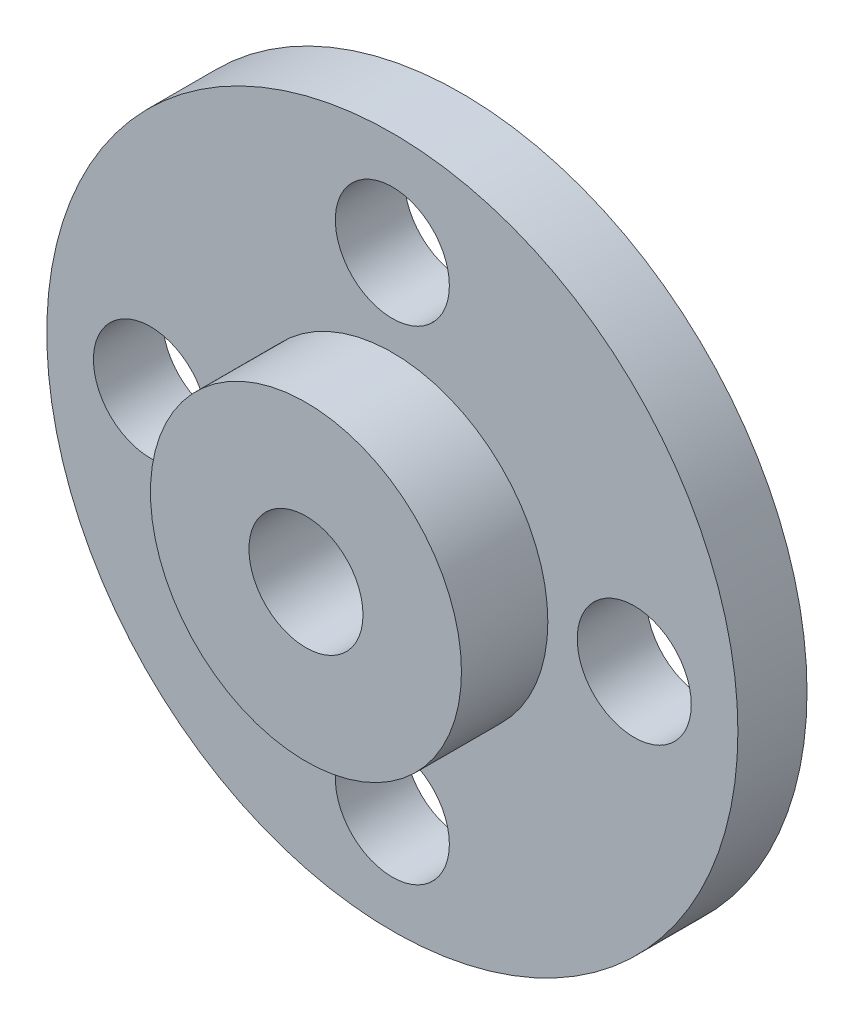
ISO-10303-21;
HEADER;
FILE_DESCRIPTION(('STEP AP214'),'2;1');
FILE_NAME('part.step','',(''),(''),'','','');
FILE_SCHEMA(('AUTOMOTIVE_DESIGN { 1 0 10303 214 1 1 1 1 }'));
ENDSEC;
DATA;
#1=APPLICATION_CONTEXT('core data for automotive mechanical design processes');
#2=APPLICATION_PROTOCOL_DEFINITION('international standard','automotive_design',2000,#1);
#3=PRODUCT_CONTEXT('',#1,'mechanical');
#4=PRODUCT('Part','Part','',(#3));
#5=PRODUCT_RELATED_PRODUCT_CATEGORY('part','',(#4));
#6=PRODUCT_DEFINITION_FORMATION('','',#4);
#7=PRODUCT_DEFINITION_CONTEXT('part definition',#1,'design');
#8=PRODUCT_DEFINITION('design','',#6,#7);
#9=PRODUCT_DEFINITION_SHAPE('','',#8);
#10=(LENGTH_UNIT() NAMED_UNIT(*) SI_UNIT(.MILLI.,.METRE.));
#11=(NAMED_UNIT(*) PLANE_ANGLE_UNIT() SI_UNIT($,.RADIAN.));
#12=(NAMED_UNIT(*) SI_UNIT($,.STERADIAN.) SOLID_ANGLE_UNIT());
#13=UNCERTAINTY_MEASURE_WITH_UNIT(LENGTH_MEASURE(1.E-05),#10,'distance_accuracy_value','');
#14=(GEOMETRIC_REPRESENTATION_CONTEXT(3) GLOBAL_UNCERTAINTY_ASSIGNED_CONTEXT((#13)) GLOBAL_UNIT_ASSIGNED_CONTEXT((#10,
#11,#12)) REPRESENTATION_CONTEXT('',''));
#15=CARTESIAN_POINT('',(0.,0.,0.));
#16=DIRECTION('',(0.,0.,1.));
#17=DIRECTION('',(1.,0.,0.));
#18=AXIS2_PLACEMENT_3D('',#15,#16,#17);
#19=CARTESIAN_POINT('',(0.,0.,2.));
#20=DIRECTION('',(0.,0.,-1.));
#21=DIRECTION('',(-1.,0.,0.));
#22=AXIS2_PLACEMENT_3D('',#19,#20,#21);
#23=CYLINDRICAL_SURFACE('',#22,10.);
#24=CARTESIAN_POINT('',(0.,0.,2.));
#25=DIRECTION('',(0.,0.,1.));
#26=DIRECTION('',(1.,0.,0.));
#27=AXIS2_PLACEMENT_3D('',#24,#25,#26);
#28=CIRCLE('',#27,10.);
#29=CARTESIAN_POINT('',(10.,0.,2.));
#30=VERTEX_POINT('',#29);
#31=EDGE_CURVE('E10',#30,#30,#28,.T.);
#32=ORIENTED_EDGE('',*,*,#31,.F.);
#33=EDGE_LOOP('',(#32));
#34=FACE_BOUND('',#33,.T.);
#35=CARTESIAN_POINT('',(0.,0.,0.));
#36=DIRECTION('',(0.,0.,1.));
#37=DIRECTION('',(1.,0.,0.));
#38=AXIS2_PLACEMENT_3D('',#35,#36,#37);
#39=CIRCLE('',#38,10.);
#40=CARTESIAN_POINT('',(10.,0.,0.));
#41=VERTEX_POINT('',#40);
#42=EDGE_CURVE('E44',#41,#41,#39,.T.);
#43=ORIENTED_EDGE('',*,*,#42,.T.);
#44=EDGE_LOOP('',(#43));
#45=FACE_BOUND('',#44,.T.);
#46=ADVANCED_FACE('F37',(#34,#45),#23,.T.);
#47=CARTESIAN_POINT('',(0.,0.,2.));
#48=DIRECTION('',(0.,0.,1.));
#49=DIRECTION('',(1.,0.,0.));
#50=AXIS2_PLACEMENT_3D('',#47,#48,#49);
#51=PLANE('',#50);
#52=CARTESIAN_POINT('',(7.0000000000002,1.98094713253425E-13,2.));
#53=DIRECTION('',(0.,0.,1.));
#54=DIRECTION('',(1.,0.,0.));
#55=AXIS2_PLACEMENT_3D('',#52,#53,#54);
#56=CIRCLE('',#55,1.65000000000016);
#57=CARTESIAN_POINT('',(8.65000000000035,1.98094713253425E-13,2.));
#58=VERTEX_POINT('',#57);
#59=EDGE_CURVE('E63',#58,#58,#56,.T.);
#60=ORIENTED_EDGE('',*,*,#59,.F.);
#61=EDGE_LOOP('',(#60));
#62=FACE_BOUND('',#61,.T.);
#63=CARTESIAN_POINT('',(3.9618942650685E-13,-7.,2.));
#64=DIRECTION('',(0.,0.,1.));
#65=DIRECTION('',(1.,0.,0.));
#66=AXIS2_PLACEMENT_3D('',#63,#64,#65);
#67=CIRCLE('',#66,1.65000000000043);
#68=CARTESIAN_POINT('',(1.65000000000082,-7.,2.));
#69=VERTEX_POINT('',#68);
#70=EDGE_CURVE('E132',#69,#69,#67,.T.);
#71=ORIENTED_EDGE('',*,*,#70,.F.);
#72=EDGE_LOOP('',(#71));
#73=FACE_BOUND('',#72,.T.);
#74=CARTESIAN_POINT('',(-6.9999999999998,-1.98951966012828E-13,2.));
#75=DIRECTION('',(0.,0.,1.));
#76=DIRECTION('',(1.,0.,0.));
#77=AXIS2_PLACEMENT_3D('',#74,#75,#76);
#78=CIRCLE('',#77,1.65000000000032);
#79=CARTESIAN_POINT('',(-5.34999999999948,-1.98951966012828E-13,2.));
#80=VERTEX_POINT('',#79);
#81=EDGE_CURVE('E76',#80,#80,#78,.T.);
#82=ORIENTED_EDGE('',*,*,#81,.F.);
#83=EDGE_LOOP('',(#82));
#84=FACE_BOUND('',#83,.T.);
#85=CARTESIAN_POINT('',(0.,7.,2.));
#86=DIRECTION('',(0.,0.,1.));
#87=DIRECTION('',(1.,0.,0.));
#88=AXIS2_PLACEMENT_3D('',#85,#86,#87);
#89=CIRCLE('',#88,1.65);
#90=CARTESIAN_POINT('',(1.65,7.,2.));
#91=VERTEX_POINT('',#90);
#92=EDGE_CURVE('E59',#91,#91,#89,.T.);
#93=ORIENTED_EDGE('',*,*,#92,.F.);
#94=EDGE_LOOP('',(#93));
#95=FACE_BOUND('',#94,.T.);
#96=CARTESIAN_POINT('',(0.,0.,2.));
#97=DIRECTION('',(0.,0.,1.));
#98=DIRECTION('',(1.,0.,0.));
#99=AXIS2_PLACEMENT_3D('',#96,#97,#98);
#100=CIRCLE('',#99,4.5);
#101=CARTESIAN_POINT('',(4.5,0.,2.));
#102=VERTEX_POINT('',#101);
#103=EDGE_CURVE('E52',#102,#102,#100,.T.);
#104=ORIENTED_EDGE('',*,*,#103,.F.);
#105=EDGE_LOOP('',(#104));
#106=FACE_BOUND('',#105,.T.);
#107=ORIENTED_EDGE('',*,*,#31,.T.);
#108=EDGE_LOOP('',(#107));
#109=FACE_BOUND('',#108,.T.);
#110=ADVANCED_FACE('F90',(#62,#73,#84,#95,#106,#109),#51,.T.);
#111=CARTESIAN_POINT('',(0.,0.,0.));
#112=DIRECTION('',(0.,0.,1.));
#113=DIRECTION('',(1.,0.,0.));
#114=AXIS2_PLACEMENT_3D('',#111,#112,#113);
#115=PLANE('',#114);
#116=CARTESIAN_POINT('',(7.0000000000002,1.98094713253425E-13,0.));
#117=DIRECTION('',(0.,0.,1.));
#118=DIRECTION('',(1.,0.,0.));
#119=AXIS2_PLACEMENT_3D('',#116,#117,#118);
#120=CIRCLE('',#119,1.65000000000016);
#121=CARTESIAN_POINT('',(8.65000000000035,1.98094713253425E-13,0.));
#122=VERTEX_POINT('',#121);
#123=EDGE_CURVE('E40',#122,#122,#120,.T.);
#124=ORIENTED_EDGE('',*,*,#123,.T.);
#125=EDGE_LOOP('',(#124));
#126=FACE_BOUND('',#125,.T.);
#127=CARTESIAN_POINT('',(3.9618942650685E-13,-7.,0.));
#128=DIRECTION('',(0.,0.,1.));
#129=DIRECTION('',(1.,0.,0.));
#130=AXIS2_PLACEMENT_3D('',#127,#128,#129);
#131=CIRCLE('',#130,1.65000000000043);
#132=CARTESIAN_POINT('',(1.65000000000082,-7.,0.));
#133=VERTEX_POINT('',#132);
#134=EDGE_CURVE('E62',#133,#133,#131,.T.);
#135=ORIENTED_EDGE('',*,*,#134,.T.);
#136=EDGE_LOOP('',(#135));
#137=FACE_BOUND('',#136,.T.);
#138=CARTESIAN_POINT('',(-6.9999999999998,-1.98951966012828E-13,0.));
#139=DIRECTION('',(0.,0.,1.));
#140=DIRECTION('',(1.,0.,0.));
#141=AXIS2_PLACEMENT_3D('',#138,#139,#140);
#142=CIRCLE('',#141,1.65000000000032);
#143=CARTESIAN_POINT('',(-5.34999999999948,-1.98951966012828E-13,0.));
#144=VERTEX_POINT('',#143);
#145=EDGE_CURVE('E60',#144,#144,#142,.T.);
#146=ORIENTED_EDGE('',*,*,#145,.T.);
#147=EDGE_LOOP('',(#146));
#148=FACE_BOUND('',#147,.T.);
#149=CARTESIAN_POINT('',(0.,7.,0.));
#150=DIRECTION('',(0.,0.,1.));
#151=DIRECTION('',(1.,0.,0.));
#152=AXIS2_PLACEMENT_3D('',#149,#150,#151);
#153=CIRCLE('',#152,1.65);
#154=CARTESIAN_POINT('',(1.65,7.,0.));
#155=VERTEX_POINT('',#154);
#156=EDGE_CURVE('E55',#155,#155,#153,.T.);
#157=ORIENTED_EDGE('',*,*,#156,.T.);
#158=EDGE_LOOP('',(#157));
#159=FACE_BOUND('',#158,.T.);
#160=CARTESIAN_POINT('',(0.,0.,0.));
#161=DIRECTION('',(0.,0.,1.));
#162=DIRECTION('',(1.,0.,0.));
#163=AXIS2_PLACEMENT_3D('',#160,#161,#162);
#164=CIRCLE('',#163,1.65);
#165=CARTESIAN_POINT('',(1.65,0.,0.));
#166=VERTEX_POINT('',#165);
#167=EDGE_CURVE('E80',#166,#166,#164,.T.);
#168=ORIENTED_EDGE('',*,*,#167,.T.);
#169=EDGE_LOOP('',(#168));
#170=FACE_BOUND('',#169,.T.);
#171=ORIENTED_EDGE('',*,*,#42,.F.);
#172=EDGE_LOOP('',(#171));
#173=FACE_BOUND('',#172,.T.);
#174=ADVANCED_FACE('F92',(#126,#137,#148,#159,#170,#173),#115,.F.);
#175=CARTESIAN_POINT('',(0.,0.,4.5));
#176=DIRECTION('',(0.,0.,-1.));
#177=DIRECTION('',(-1.,0.,0.));
#178=AXIS2_PLACEMENT_3D('',#175,#176,#177);
#179=CYLINDRICAL_SURFACE('',#178,4.5);
#180=CARTESIAN_POINT('',(0.,0.,4.5));
#181=DIRECTION('',(0.,0.,1.));
#182=DIRECTION('',(1.,0.,0.));
#183=AXIS2_PLACEMENT_3D('',#180,#181,#182);
#184=CIRCLE('',#183,4.5);
#185=CARTESIAN_POINT('',(4.5,0.,4.5));
#186=VERTEX_POINT('',#185);
#187=EDGE_CURVE('E49',#186,#186,#184,.T.);
#188=ORIENTED_EDGE('',*,*,#187,.F.);
#189=EDGE_LOOP('',(#188));
#190=FACE_BOUND('',#189,.T.);
#191=ORIENTED_EDGE('',*,*,#103,.T.);
#192=EDGE_LOOP('',(#191));
#193=FACE_BOUND('',#192,.T.);
#194=ADVANCED_FACE('F88',(#190,#193),#179,.T.);
#195=CARTESIAN_POINT('',(0.,0.,4.5));
#196=DIRECTION('',(0.,0.,1.));
#197=DIRECTION('',(1.,0.,0.));
#198=AXIS2_PLACEMENT_3D('',#195,#196,#197);
#199=PLANE('',#198);
#200=CARTESIAN_POINT('',(0.,0.,4.5));
#201=DIRECTION('',(0.,0.,1.));
#202=DIRECTION('',(1.,0.,0.));
#203=AXIS2_PLACEMENT_3D('',#200,#201,#202);
#204=CIRCLE('',#203,1.65);
#205=CARTESIAN_POINT('',(1.65,0.,4.5));
#206=VERTEX_POINT('',#205);
#207=EDGE_CURVE('E58',#206,#206,#204,.T.);
#208=ORIENTED_EDGE('',*,*,#207,.F.);
#209=EDGE_LOOP('',(#208));
#210=FACE_BOUND('',#209,.T.);
#211=ORIENTED_EDGE('',*,*,#187,.T.);
#212=EDGE_LOOP('',(#211));
#213=FACE_BOUND('',#212,.T.);
#214=ADVANCED_FACE('F105',(#210,#213),#199,.T.);
#215=CARTESIAN_POINT('',(0.,0.,-4.));
#216=DIRECTION('',(0.,0.,1.));
#217=DIRECTION('',(1.,0.,0.));
#218=AXIS2_PLACEMENT_3D('',#215,#216,#217);
#219=CYLINDRICAL_SURFACE('',#218,1.65);
#220=ORIENTED_EDGE('',*,*,#207,.T.);
#221=EDGE_LOOP('',(#220));
#222=FACE_BOUND('',#221,.T.);
#223=ORIENTED_EDGE('',*,*,#167,.F.);
#224=EDGE_LOOP('',(#223));
#225=FACE_BOUND('',#224,.T.);
#226=ADVANCED_FACE('F109',(#222,#225),#219,.F.);
#227=CARTESIAN_POINT('',(0.,7.,-6.5));
#228=DIRECTION('',(0.,0.,1.));
#229=DIRECTION('',(1.,0.,0.));
#230=AXIS2_PLACEMENT_3D('',#227,#228,#229);
#231=CYLINDRICAL_SURFACE('',#230,1.65);
#232=ORIENTED_EDGE('',*,*,#92,.T.);
#233=EDGE_LOOP('',(#232));
#234=FACE_BOUND('',#233,.T.);
#235=ORIENTED_EDGE('',*,*,#156,.F.);
#236=EDGE_LOOP('',(#235));
#237=FACE_BOUND('',#236,.T.);
#238=ADVANCED_FACE('F113',(#234,#237),#231,.F.);
#239=CARTESIAN_POINT('',(-6.9999999999998,-1.98951966012828E-13,-6.5));
#240=DIRECTION('',(0.,0.,1.));
#241=DIRECTION('',(1.,0.,0.));
#242=AXIS2_PLACEMENT_3D('',#239,#240,#241);
#243=CYLINDRICAL_SURFACE('',#242,1.65000000000032);
#244=ORIENTED_EDGE('',*,*,#81,.T.);
#245=EDGE_LOOP('',(#244));
#246=FACE_BOUND('',#245,.T.);
#247=ORIENTED_EDGE('',*,*,#145,.F.);
#248=EDGE_LOOP('',(#247));
#249=FACE_BOUND('',#248,.T.);
#250=ADVANCED_FACE('F117',(#246,#249),#243,.F.);
#251=CARTESIAN_POINT('',(3.9618942650685E-13,-7.,-6.5));
#252=DIRECTION('',(0.,0.,1.));
#253=DIRECTION('',(1.,0.,0.));
#254=AXIS2_PLACEMENT_3D('',#251,#252,#253);
#255=CYLINDRICAL_SURFACE('',#254,1.65000000000043);
#256=ORIENTED_EDGE('',*,*,#70,.T.);
#257=EDGE_LOOP('',(#256));
#258=FACE_BOUND('',#257,.T.);
#259=ORIENTED_EDGE('',*,*,#134,.F.);
#260=EDGE_LOOP('',(#259));
#261=FACE_BOUND('',#260,.T.);
#262=ADVANCED_FACE('F120',(#258,#261),#255,.F.);
#263=CARTESIAN_POINT('',(7.0000000000002,1.98094713253425E-13,-6.5));
#264=DIRECTION('',(0.,0.,1.));
#265=DIRECTION('',(1.,0.,0.));
#266=AXIS2_PLACEMENT_3D('',#263,#264,#265);
#267=CYLINDRICAL_SURFACE('',#266,1.65000000000016);
#268=ORIENTED_EDGE('',*,*,#59,.T.);
#269=EDGE_LOOP('',(#268));
#270=FACE_BOUND('',#269,.T.);
#271=ORIENTED_EDGE('',*,*,#123,.F.);
#272=EDGE_LOOP('',(#271));
#273=FACE_BOUND('',#272,.T.);
#274=ADVANCED_FACE('F124',(#270,#273),#267,.F.);
#275=CLOSED_SHELL('',(#46,#110,#174,#194,#214,#226,#238,#250,#262,#274));
#276=MANIFOLD_SOLID_BREP('B2',#275);
#277=ADVANCED_BREP_SHAPE_REPRESENTATION('',(#18,#276),#14);
#278=SHAPE_DEFINITION_REPRESENTATION(#9,#277);
ENDSEC;
END-ISO-10303-21;
